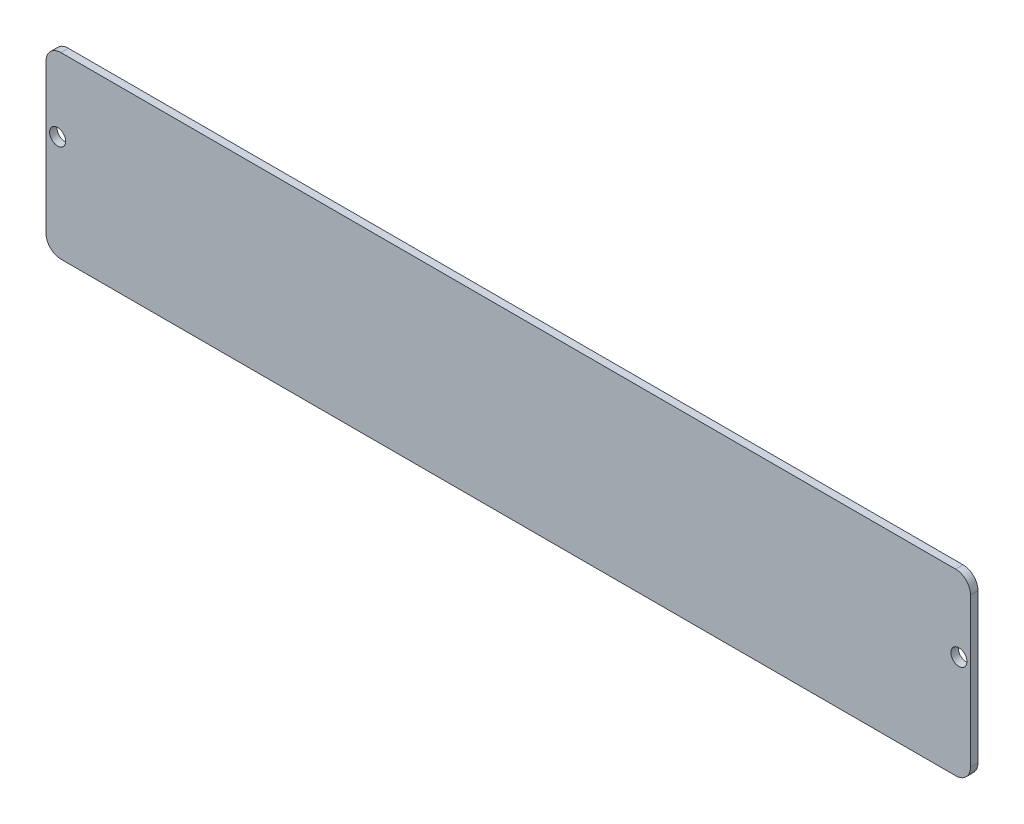
ISO-10303-21;
HEADER;
FILE_DESCRIPTION(('STEP AP214'),'2;1');
FILE_NAME('part.step','',(''),(''),'','','');
FILE_SCHEMA(('AUTOMOTIVE_DESIGN { 1 0 10303 214 1 1 1 1 }'));
ENDSEC;
DATA;
#1=APPLICATION_CONTEXT('core data for automotive mechanical design processes');
#2=APPLICATION_PROTOCOL_DEFINITION('international standard','automotive_design',2000,#1);
#3=PRODUCT_CONTEXT('',#1,'mechanical');
#4=PRODUCT('Part','Part','',(#3));
#5=PRODUCT_RELATED_PRODUCT_CATEGORY('part','',(#4));
#6=PRODUCT_DEFINITION_FORMATION('','',#4);
#7=PRODUCT_DEFINITION_CONTEXT('part definition',#1,'design');
#8=PRODUCT_DEFINITION('design','',#6,#7);
#9=PRODUCT_DEFINITION_SHAPE('','',#8);
#10=(LENGTH_UNIT() NAMED_UNIT(*) SI_UNIT(.MILLI.,.METRE.));
#11=(NAMED_UNIT(*) PLANE_ANGLE_UNIT() SI_UNIT($,.RADIAN.));
#12=(NAMED_UNIT(*) SI_UNIT($,.STERADIAN.) SOLID_ANGLE_UNIT());
#13=UNCERTAINTY_MEASURE_WITH_UNIT(LENGTH_MEASURE(1.E-05),#10,'distance_accuracy_value','');
#14=(GEOMETRIC_REPRESENTATION_CONTEXT(3) GLOBAL_UNCERTAINTY_ASSIGNED_CONTEXT((#13)) GLOBAL_UNIT_ASSIGNED_CONTEXT((#10,
#11,#12)) REPRESENTATION_CONTEXT('',''));
#15=CARTESIAN_POINT('',(0.,0.,0.));
#16=DIRECTION('',(0.,0.,1.));
#17=DIRECTION('',(1.,0.,0.));
#18=AXIS2_PLACEMENT_3D('',#15,#16,#17);
#19=CARTESIAN_POINT('',(190.5,6.34999999999997,3.175));
#20=DIRECTION('',(0.,0.,1.));
#21=DIRECTION('',(1.,0.,0.));
#22=AXIS2_PLACEMENT_3D('',#19,#20,#21);
#23=PLANE('',#22);
#24=CARTESIAN_POINT('',(191.897,44.45,3.175));
#25=DIRECTION('',(0.,0.,1.));
#26=DIRECTION('',(1.,0.,0.));
#27=AXIS2_PLACEMENT_3D('',#24,#25,#26);
#28=CIRCLE('',#27,3.429);
#29=CARTESIAN_POINT('',(195.326,44.45,3.175));
#30=VERTEX_POINT('',#29);
#31=EDGE_CURVE('E143',#30,#30,#28,.T.);
#32=ORIENTED_EDGE('',*,*,#31,.F.);
#33=EDGE_LOOP('',(#32));
#34=FACE_BOUND('',#33,.T.);
#35=CARTESIAN_POINT('',(190.5,6.34999999999997,3.175));
#36=DIRECTION('',(0.,0.,1.));
#37=DIRECTION('',(1.,0.,0.));
#38=AXIS2_PLACEMENT_3D('',#35,#36,#37);
#39=CIRCLE('',#38,6.34999999999997);
#40=CARTESIAN_POINT('',(190.5,0.,3.175));
#41=VERTEX_POINT('',#40);
#42=CARTESIAN_POINT('',(196.85,6.34999999999997,3.175));
#43=VERTEX_POINT('',#42);
#44=EDGE_CURVE('E154',#41,#43,#39,.T.);
#45=ORIENTED_EDGE('',*,*,#44,.T.);
#46=DIRECTION('',(0.,1.,0.));
#47=VECTOR('',#46,1.);
#48=CARTESIAN_POINT('',(196.85,69.8500000000001,3.175));
#49=LINE('',#48,#47);
#50=CARTESIAN_POINT('',(196.85,69.8500000000001,3.175));
#51=VERTEX_POINT('',#50);
#52=EDGE_CURVE('E102',#43,#51,#49,.T.);
#53=ORIENTED_EDGE('',*,*,#52,.T.);
#54=CARTESIAN_POINT('',(190.5,69.85,3.175));
#55=DIRECTION('',(0.,0.,1.));
#56=DIRECTION('',(1.,0.,0.));
#57=AXIS2_PLACEMENT_3D('',#54,#55,#56);
#58=CIRCLE('',#57,6.35000000000002);
#59=CARTESIAN_POINT('',(190.5,76.2,3.175));
#60=VERTEX_POINT('',#59);
#61=EDGE_CURVE('E169',#51,#60,#58,.T.);
#62=ORIENTED_EDGE('',*,*,#61,.T.);
#63=DIRECTION('',(-1.,0.,0.));
#64=VECTOR('',#63,1.);
#65=CARTESIAN_POINT('',(-190.5,76.2,3.175));
#66=LINE('',#65,#64);
#67=CARTESIAN_POINT('',(-190.5,76.2,3.175));
#68=VERTEX_POINT('',#67);
#69=EDGE_CURVE('E182',#60,#68,#66,.T.);
#70=ORIENTED_EDGE('',*,*,#69,.T.);
#71=CARTESIAN_POINT('',(-190.5,69.85,3.175));
#72=DIRECTION('',(0.,0.,1.));
#73=DIRECTION('',(-1.,0.,0.));
#74=AXIS2_PLACEMENT_3D('',#71,#72,#73);
#75=CIRCLE('',#74,6.34999999999997);
#76=CARTESIAN_POINT('',(-196.85,69.85,3.175));
#77=VERTEX_POINT('',#76);
#78=EDGE_CURVE('E121',#68,#77,#75,.T.);
#79=ORIENTED_EDGE('',*,*,#78,.T.);
#80=DIRECTION('',(0.,-1.,0.));
#81=VECTOR('',#80,1.);
#82=CARTESIAN_POINT('',(-196.85,69.85,3.175));
#83=LINE('',#82,#81);
#84=CARTESIAN_POINT('',(-196.85,6.34999999999997,3.175));
#85=VERTEX_POINT('',#84);
#86=EDGE_CURVE('E115',#77,#85,#83,.T.);
#87=ORIENTED_EDGE('',*,*,#86,.T.);
#88=CARTESIAN_POINT('',(-190.5,6.34999999999997,3.175));
#89=DIRECTION('',(0.,0.,1.));
#90=DIRECTION('',(-1.,0.,0.));
#91=AXIS2_PLACEMENT_3D('',#88,#89,#90);
#92=CIRCLE('',#91,6.34999999999997);
#93=CARTESIAN_POINT('',(-190.5,0.,3.175));
#94=VERTEX_POINT('',#93);
#95=EDGE_CURVE('E119',#85,#94,#92,.T.);
#96=ORIENTED_EDGE('',*,*,#95,.T.);
#97=DIRECTION('',(1.,0.,0.));
#98=VECTOR('',#97,1.);
#99=CARTESIAN_POINT('',(-190.5,0.,3.175));
#100=LINE('',#99,#98);
#101=EDGE_CURVE('E59',#94,#41,#100,.T.);
#102=ORIENTED_EDGE('',*,*,#101,.T.);
#103=EDGE_LOOP('',(#45,#53,#62,#70,#79,#87,#96,#102));
#104=FACE_BOUND('',#103,.T.);
#105=CARTESIAN_POINT('',(-191.897,44.45,3.175));
#106=DIRECTION('',(0.,0.,1.));
#107=DIRECTION('',(-1.,0.,0.));
#108=AXIS2_PLACEMENT_3D('',#105,#106,#107);
#109=CIRCLE('',#108,3.429);
#110=CARTESIAN_POINT('',(-195.326,44.45,3.175));
#111=VERTEX_POINT('',#110);
#112=EDGE_CURVE('E191',#111,#111,#109,.T.);
#113=ORIENTED_EDGE('',*,*,#112,.F.);
#114=EDGE_LOOP('',(#113));
#115=FACE_BOUND('',#114,.T.);
#116=ADVANCED_FACE('F42',(#34,#104,#115),#23,.T.);
#117=CARTESIAN_POINT('',(190.5,6.34999999999997,0.));
#118=DIRECTION('',(0.,0.,1.));
#119=DIRECTION('',(1.,0.,0.));
#120=AXIS2_PLACEMENT_3D('',#117,#118,#119);
#121=PLANE('',#120);
#122=CARTESIAN_POINT('',(190.5,6.34999999999997,0.));
#123=DIRECTION('',(0.,0.,1.));
#124=DIRECTION('',(1.,0.,0.));
#125=AXIS2_PLACEMENT_3D('',#122,#123,#124);
#126=CIRCLE('',#125,6.34999999999997);
#127=CARTESIAN_POINT('',(190.5,0.,0.));
#128=VERTEX_POINT('',#127);
#129=CARTESIAN_POINT('',(196.85,6.34999999999997,0.));
#130=VERTEX_POINT('',#129);
#131=EDGE_CURVE('E139',#128,#130,#126,.T.);
#132=ORIENTED_EDGE('',*,*,#131,.F.);
#133=DIRECTION('',(1.,0.,0.));
#134=VECTOR('',#133,1.);
#135=CARTESIAN_POINT('',(-190.5,0.,0.));
#136=LINE('',#135,#134);
#137=CARTESIAN_POINT('',(-190.5,0.,0.));
#138=VERTEX_POINT('',#137);
#139=EDGE_CURVE('E94',#138,#128,#136,.T.);
#140=ORIENTED_EDGE('',*,*,#139,.F.);
#141=CARTESIAN_POINT('',(-190.5,6.34999999999997,0.));
#142=DIRECTION('',(0.,0.,1.));
#143=DIRECTION('',(-1.,0.,0.));
#144=AXIS2_PLACEMENT_3D('',#141,#142,#143);
#145=CIRCLE('',#144,6.34999999999997);
#146=CARTESIAN_POINT('',(-196.85,6.34999999999997,0.));
#147=VERTEX_POINT('',#146);
#148=EDGE_CURVE('E88',#147,#138,#145,.T.);
#149=ORIENTED_EDGE('',*,*,#148,.F.);
#150=DIRECTION('',(0.,-1.,0.));
#151=VECTOR('',#150,1.);
#152=CARTESIAN_POINT('',(-196.85,69.85,0.));
#153=LINE('',#152,#151);
#154=CARTESIAN_POINT('',(-196.85,69.85,0.));
#155=VERTEX_POINT('',#154);
#156=EDGE_CURVE('E129',#155,#147,#153,.T.);
#157=ORIENTED_EDGE('',*,*,#156,.F.);
#158=CARTESIAN_POINT('',(-190.5,69.85,0.));
#159=DIRECTION('',(0.,0.,1.));
#160=DIRECTION('',(-1.,0.,0.));
#161=AXIS2_PLACEMENT_3D('',#158,#159,#160);
#162=CIRCLE('',#161,6.34999999999997);
#163=CARTESIAN_POINT('',(-190.5,76.2,0.));
#164=VERTEX_POINT('',#163);
#165=EDGE_CURVE('E149',#164,#155,#162,.T.);
#166=ORIENTED_EDGE('',*,*,#165,.F.);
#167=DIRECTION('',(-1.,0.,0.));
#168=VECTOR('',#167,1.);
#169=CARTESIAN_POINT('',(-190.5,76.2,0.));
#170=LINE('',#169,#168);
#171=CARTESIAN_POINT('',(190.5,76.2,0.));
#172=VERTEX_POINT('',#171);
#173=EDGE_CURVE('E147',#172,#164,#170,.T.);
#174=ORIENTED_EDGE('',*,*,#173,.F.);
#175=CARTESIAN_POINT('',(190.5,69.85,0.));
#176=DIRECTION('',(0.,0.,1.));
#177=DIRECTION('',(1.,0.,0.));
#178=AXIS2_PLACEMENT_3D('',#175,#176,#177);
#179=CIRCLE('',#178,6.35000000000002);
#180=CARTESIAN_POINT('',(196.85,69.8500000000001,0.));
#181=VERTEX_POINT('',#180);
#182=EDGE_CURVE('E145',#181,#172,#179,.T.);
#183=ORIENTED_EDGE('',*,*,#182,.F.);
#184=DIRECTION('',(0.,1.,0.));
#185=VECTOR('',#184,1.);
#186=CARTESIAN_POINT('',(196.85,69.8500000000001,0.));
#187=LINE('',#186,#185);
#188=EDGE_CURVE('E142',#130,#181,#187,.T.);
#189=ORIENTED_EDGE('',*,*,#188,.F.);
#190=EDGE_LOOP('',(#132,#140,#149,#157,#166,#174,#183,#189));
#191=FACE_BOUND('',#190,.T.);
#192=CARTESIAN_POINT('',(191.897,44.45,0.));
#193=DIRECTION('',(0.,0.,1.));
#194=DIRECTION('',(1.,0.,0.));
#195=AXIS2_PLACEMENT_3D('',#192,#193,#194);
#196=CIRCLE('',#195,3.429);
#197=CARTESIAN_POINT('',(195.326,44.45,0.));
#198=VERTEX_POINT('',#197);
#199=EDGE_CURVE('E188',#198,#198,#196,.T.);
#200=ORIENTED_EDGE('',*,*,#199,.T.);
#201=EDGE_LOOP('',(#200));
#202=FACE_BOUND('',#201,.T.);
#203=CARTESIAN_POINT('',(-191.897,44.45,0.));
#204=DIRECTION('',(0.,0.,1.));
#205=DIRECTION('',(-1.,0.,0.));
#206=AXIS2_PLACEMENT_3D('',#203,#204,#205);
#207=CIRCLE('',#206,3.429);
#208=CARTESIAN_POINT('',(-195.326,44.45,0.));
#209=VERTEX_POINT('',#208);
#210=EDGE_CURVE('E194',#209,#209,#207,.T.);
#211=ORIENTED_EDGE('',*,*,#210,.T.);
#212=EDGE_LOOP('',(#211));
#213=FACE_BOUND('',#212,.T.);
#214=ADVANCED_FACE('F173',(#191,#202,#213),#121,.F.);
#215=CARTESIAN_POINT('',(190.5,6.34999999999997,3.175));
#216=DIRECTION('',(0.,0.,-1.));
#217=DIRECTION('',(-1.,0.,0.));
#218=AXIS2_PLACEMENT_3D('',#215,#216,#217);
#219=CYLINDRICAL_SURFACE('',#218,6.34999999999997);
#220=ORIENTED_EDGE('',*,*,#131,.T.);
#221=DIRECTION('',(0.,0.,-1.));
#222=VECTOR('',#221,1.);
#223=CARTESIAN_POINT('',(196.85,6.34999999999997,3.175));
#224=LINE('',#223,#222);
#225=EDGE_CURVE('E11',#43,#130,#224,.T.);
#226=ORIENTED_EDGE('',*,*,#225,.F.);
#227=ORIENTED_EDGE('',*,*,#44,.F.);
#228=DIRECTION('',(0.,0.,-1.));
#229=VECTOR('',#228,1.);
#230=CARTESIAN_POINT('',(190.5,0.,3.175));
#231=LINE('',#230,#229);
#232=EDGE_CURVE('E135',#41,#128,#231,.T.);
#233=ORIENTED_EDGE('',*,*,#232,.T.);
#234=EDGE_LOOP('',(#220,#226,#227,#233));
#235=FACE_BOUND('',#234,.T.);
#236=ADVANCED_FACE('F44',(#235),#219,.T.);
#237=CARTESIAN_POINT('',(196.85,69.8500000000001,3.175));
#238=DIRECTION('',(-1.,0.,0.));
#239=DIRECTION('',(0.,0.,1.));
#240=AXIS2_PLACEMENT_3D('',#237,#238,#239);
#241=PLANE('',#240);
#242=ORIENTED_EDGE('',*,*,#188,.T.);
#243=DIRECTION('',(0.,0.,-1.));
#244=VECTOR('',#243,1.);
#245=CARTESIAN_POINT('',(196.85,69.8500000000001,3.175));
#246=LINE('',#245,#244);
#247=EDGE_CURVE('E51',#51,#181,#246,.T.);
#248=ORIENTED_EDGE('',*,*,#247,.F.);
#249=ORIENTED_EDGE('',*,*,#52,.F.);
#250=ORIENTED_EDGE('',*,*,#225,.T.);
#251=EDGE_LOOP('',(#242,#248,#249,#250));
#252=FACE_BOUND('',#251,.T.);
#253=ADVANCED_FACE('F226',(#252),#241,.F.);
#254=CARTESIAN_POINT('',(190.5,69.85,3.175));
#255=DIRECTION('',(0.,0.,-1.));
#256=DIRECTION('',(-1.,0.,0.));
#257=AXIS2_PLACEMENT_3D('',#254,#255,#256);
#258=CYLINDRICAL_SURFACE('',#257,6.35000000000002);
#259=ORIENTED_EDGE('',*,*,#182,.T.);
#260=DIRECTION('',(0.,0.,-1.));
#261=VECTOR('',#260,1.);
#262=CARTESIAN_POINT('',(190.5,76.2,3.175));
#263=LINE('',#262,#261);
#264=EDGE_CURVE('E161',#60,#172,#263,.T.);
#265=ORIENTED_EDGE('',*,*,#264,.F.);
#266=ORIENTED_EDGE('',*,*,#61,.F.);
#267=ORIENTED_EDGE('',*,*,#247,.T.);
#268=EDGE_LOOP('',(#259,#265,#266,#267));
#269=FACE_BOUND('',#268,.T.);
#270=ADVANCED_FACE('F167',(#269),#258,.T.);
#271=CARTESIAN_POINT('',(-190.5,76.2,3.175));
#272=DIRECTION('',(0.,-1.,0.));
#273=DIRECTION('',(1.,0.,0.));
#274=AXIS2_PLACEMENT_3D('',#271,#272,#273);
#275=PLANE('',#274);
#276=ORIENTED_EDGE('',*,*,#173,.T.);
#277=DIRECTION('',(0.,0.,-1.));
#278=VECTOR('',#277,1.);
#279=CARTESIAN_POINT('',(-190.5,76.2,3.175));
#280=LINE('',#279,#278);
#281=EDGE_CURVE('E158',#68,#164,#280,.T.);
#282=ORIENTED_EDGE('',*,*,#281,.F.);
#283=ORIENTED_EDGE('',*,*,#69,.F.);
#284=ORIENTED_EDGE('',*,*,#264,.T.);
#285=EDGE_LOOP('',(#276,#282,#283,#284));
#286=FACE_BOUND('',#285,.T.);
#287=ADVANCED_FACE('F178',(#286),#275,.F.);
#288=CARTESIAN_POINT('',(-190.5,69.85,3.175));
#289=DIRECTION('',(0.,0.,-1.));
#290=DIRECTION('',(-1.,0.,0.));
#291=AXIS2_PLACEMENT_3D('',#288,#289,#290);
#292=CYLINDRICAL_SURFACE('',#291,6.34999999999997);
#293=ORIENTED_EDGE('',*,*,#165,.T.);
#294=DIRECTION('',(0.,0.,-1.));
#295=VECTOR('',#294,1.);
#296=CARTESIAN_POINT('',(-196.85,69.85,3.175));
#297=LINE('',#296,#295);
#298=EDGE_CURVE('E130',#77,#155,#297,.T.);
#299=ORIENTED_EDGE('',*,*,#298,.F.);
#300=ORIENTED_EDGE('',*,*,#78,.F.);
#301=ORIENTED_EDGE('',*,*,#281,.T.);
#302=EDGE_LOOP('',(#293,#299,#300,#301));
#303=FACE_BOUND('',#302,.T.);
#304=ADVANCED_FACE('F181',(#303),#292,.T.);
#305=CARTESIAN_POINT('',(-196.85,69.85,3.175));
#306=DIRECTION('',(1.,0.,0.));
#307=DIRECTION('',(0.,1.,0.));
#308=AXIS2_PLACEMENT_3D('',#305,#306,#307);
#309=PLANE('',#308);
#310=ORIENTED_EDGE('',*,*,#156,.T.);
#311=DIRECTION('',(0.,0.,-1.));
#312=VECTOR('',#311,1.);
#313=CARTESIAN_POINT('',(-196.85,6.34999999999997,3.175));
#314=LINE('',#313,#312);
#315=EDGE_CURVE('E126',#85,#147,#314,.T.);
#316=ORIENTED_EDGE('',*,*,#315,.F.);
#317=ORIENTED_EDGE('',*,*,#86,.F.);
#318=ORIENTED_EDGE('',*,*,#298,.T.);
#319=EDGE_LOOP('',(#310,#316,#317,#318));
#320=FACE_BOUND('',#319,.T.);
#321=ADVANCED_FACE('F127',(#320),#309,.F.);
#322=CARTESIAN_POINT('',(-190.5,6.34999999999997,3.175));
#323=DIRECTION('',(0.,0.,-1.));
#324=DIRECTION('',(-1.,0.,0.));
#325=AXIS2_PLACEMENT_3D('',#322,#323,#324);
#326=CYLINDRICAL_SURFACE('',#325,6.34999999999997);
#327=ORIENTED_EDGE('',*,*,#148,.T.);
#328=DIRECTION('',(0.,0.,-1.));
#329=VECTOR('',#328,1.);
#330=CARTESIAN_POINT('',(-190.5,0.,3.175));
#331=LINE('',#330,#329);
#332=EDGE_CURVE('E131',#94,#138,#331,.T.);
#333=ORIENTED_EDGE('',*,*,#332,.F.);
#334=ORIENTED_EDGE('',*,*,#95,.F.);
#335=ORIENTED_EDGE('',*,*,#315,.T.);
#336=EDGE_LOOP('',(#327,#333,#334,#335));
#337=FACE_BOUND('',#336,.T.);
#338=ADVANCED_FACE('F133',(#337),#326,.T.);
#339=CARTESIAN_POINT('',(-190.5,0.,3.175));
#340=DIRECTION('',(0.,1.,0.));
#341=DIRECTION('',(0.,0.,1.));
#342=AXIS2_PLACEMENT_3D('',#339,#340,#341);
#343=PLANE('',#342);
#344=ORIENTED_EDGE('',*,*,#139,.T.);
#345=ORIENTED_EDGE('',*,*,#232,.F.);
#346=ORIENTED_EDGE('',*,*,#101,.F.);
#347=ORIENTED_EDGE('',*,*,#332,.T.);
#348=EDGE_LOOP('',(#344,#345,#346,#347));
#349=FACE_BOUND('',#348,.T.);
#350=ADVANCED_FACE('F214',(#349),#343,.F.);
#351=CARTESIAN_POINT('',(191.897,44.45,3.175));
#352=DIRECTION('',(0.,0.,-1.));
#353=DIRECTION('',(-1.,0.,0.));
#354=AXIS2_PLACEMENT_3D('',#351,#352,#353);
#355=CYLINDRICAL_SURFACE('',#354,3.429);
#356=ORIENTED_EDGE('',*,*,#31,.T.);
#357=EDGE_LOOP('',(#356));
#358=FACE_BOUND('',#357,.T.);
#359=ORIENTED_EDGE('',*,*,#199,.F.);
#360=EDGE_LOOP('',(#359));
#361=FACE_BOUND('',#360,.T.);
#362=ADVANCED_FACE('F211',(#358,#361),#355,.F.);
#363=CARTESIAN_POINT('',(-191.897,44.45,3.175));
#364=DIRECTION('',(0.,0.,-1.));
#365=DIRECTION('',(-1.,0.,0.));
#366=AXIS2_PLACEMENT_3D('',#363,#364,#365);
#367=CYLINDRICAL_SURFACE('',#366,3.429);
#368=ORIENTED_EDGE('',*,*,#112,.T.);
#369=EDGE_LOOP('',(#368));
#370=FACE_BOUND('',#369,.T.);
#371=ORIENTED_EDGE('',*,*,#210,.F.);
#372=EDGE_LOOP('',(#371));
#373=FACE_BOUND('',#372,.T.);
#374=ADVANCED_FACE('F200',(#370,#373),#367,.F.);
#375=CLOSED_SHELL('',(#116,#214,#236,#253,#270,#287,#304,#321,#338,#350,#362,#374));
#376=MANIFOLD_SOLID_BREP('B2',#375);
#377=ADVANCED_BREP_SHAPE_REPRESENTATION('',(#18,#376),#14);
#378=SHAPE_DEFINITION_REPRESENTATION(#9,#377);
ENDSEC;
END-ISO-10303-21;
